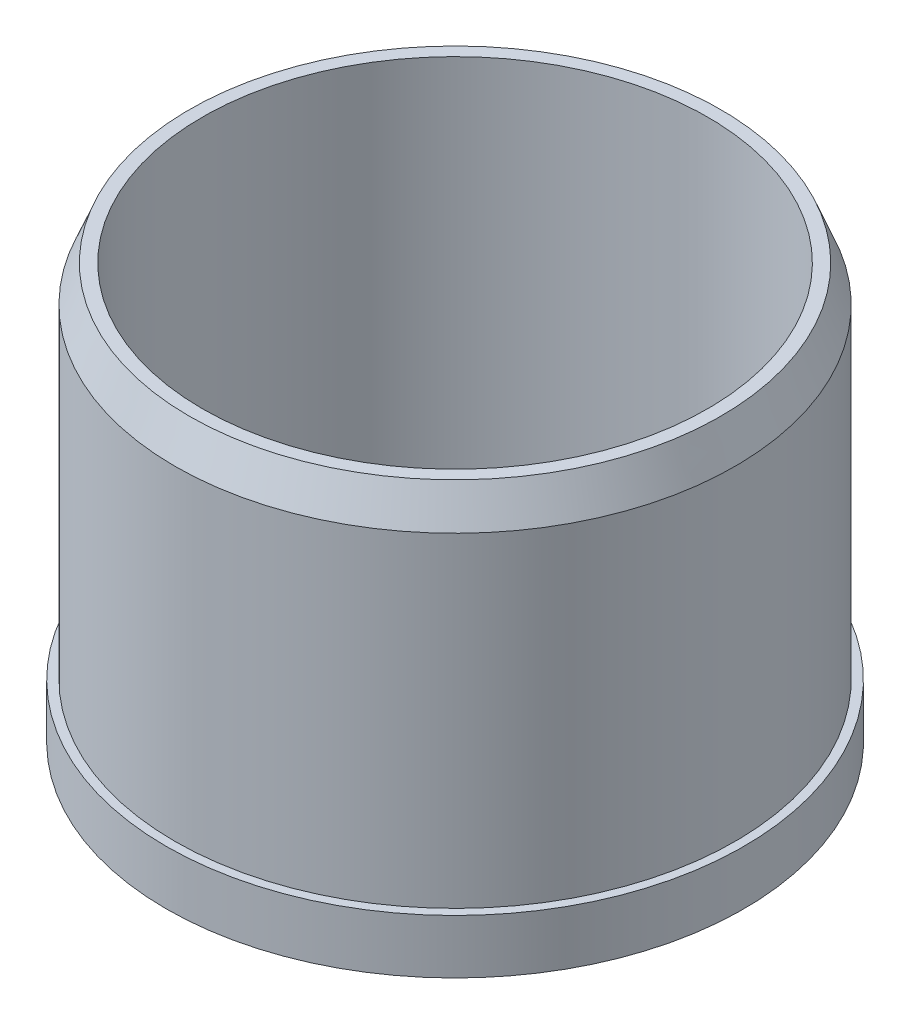
ISO-10303-21;
HEADER;
FILE_DESCRIPTION(('STEP AP214'),'2;1');
FILE_NAME('part.step','',(''),(''),'','','');
FILE_SCHEMA(('AUTOMOTIVE_DESIGN { 1 0 10303 214 1 1 1 1 }'));
ENDSEC;
DATA;
#1=APPLICATION_CONTEXT('core data for automotive mechanical design processes');
#2=APPLICATION_PROTOCOL_DEFINITION('international standard','automotive_design',2000,#1);
#3=PRODUCT_CONTEXT('',#1,'mechanical');
#4=PRODUCT('Part','Part','',(#3));
#5=PRODUCT_RELATED_PRODUCT_CATEGORY('part','',(#4));
#6=PRODUCT_DEFINITION_FORMATION('','',#4);
#7=PRODUCT_DEFINITION_CONTEXT('part definition',#1,'design');
#8=PRODUCT_DEFINITION('design','',#6,#7);
#9=PRODUCT_DEFINITION_SHAPE('','',#8);
#10=(LENGTH_UNIT() NAMED_UNIT(*) SI_UNIT(.MILLI.,.METRE.));
#11=(NAMED_UNIT(*) PLANE_ANGLE_UNIT() SI_UNIT($,.RADIAN.));
#12=(NAMED_UNIT(*) SI_UNIT($,.STERADIAN.) SOLID_ANGLE_UNIT());
#13=UNCERTAINTY_MEASURE_WITH_UNIT(LENGTH_MEASURE(1.E-05),#10,'distance_accuracy_value','');
#14=(GEOMETRIC_REPRESENTATION_CONTEXT(3) GLOBAL_UNCERTAINTY_ASSIGNED_CONTEXT((#13)) GLOBAL_UNIT_ASSIGNED_CONTEXT((#10,
#11,#12)) REPRESENTATION_CONTEXT('',''));
#15=CARTESIAN_POINT('',(0.,0.,0.));
#16=DIRECTION('',(0.,0.,1.));
#17=DIRECTION('',(1.,0.,0.));
#18=AXIS2_PLACEMENT_3D('',#15,#16,#17);
#19=CARTESIAN_POINT('',(0.,9.525,0.));
#20=DIRECTION('',(0.,1.,0.));
#21=DIRECTION('',(0.,0.,1.));
#22=AXIS2_PLACEMENT_3D('',#19,#20,#21);
#23=PLANE('',#22);
#24=CARTESIAN_POINT('',(0.,9.525,0.));
#25=DIRECTION('',(0.,1.,0.));
#26=DIRECTION('',(0.,0.,1.));
#27=AXIS2_PLACEMENT_3D('',#24,#25,#26);
#28=CIRCLE('',#27,12.7);
#29=CARTESIAN_POINT('',(0.,9.525,12.7));
#30=VERTEX_POINT('',#29);
#31=EDGE_CURVE('E88',#30,#30,#28,.T.);
#32=ORIENTED_EDGE('',*,*,#31,.F.);
#33=EDGE_LOOP('',(#32));
#34=FACE_BOUND('',#33,.T.);
#35=CARTESIAN_POINT('',(27.1764399531351,9.525,-8.83016061426567));
#36=DIRECTION('',(0.,1.,0.));
#37=DIRECTION('',(0.,0.,1.));
#38=AXIS2_PLACEMENT_3D('',#35,#36,#37);
#39=CIRCLE('',#38,12.7000000000007);
#40=CARTESIAN_POINT('',(27.1764399531351,9.525,3.86983938573504));
#41=VERTEX_POINT('',#40);
#42=EDGE_CURVE('E134',#41,#41,#39,.T.);
#43=ORIENTED_EDGE('',*,*,#42,.F.);
#44=EDGE_LOOP('',(#43));
#45=FACE_BOUND('',#44,.T.);
#46=CARTESIAN_POINT('',(16.7959635842603,9.525,23.1176606142632));
#47=DIRECTION('',(0.,1.,0.));
#48=DIRECTION('',(0.,0.,1.));
#49=AXIS2_PLACEMENT_3D('',#46,#47,#48);
#50=CIRCLE('',#49,12.7000000000027);
#51=CARTESIAN_POINT('',(16.7959635842603,9.525,35.8176606142658));
#52=VERTEX_POINT('',#51);
#53=EDGE_CURVE('E131',#52,#52,#50,.T.);
#54=ORIENTED_EDGE('',*,*,#53,.F.);
#55=EDGE_LOOP('',(#54));
#56=FACE_BOUND('',#55,.T.);
#57=CARTESIAN_POINT('',(-16.7959635842545,9.525,23.1176606142651));
#58=DIRECTION('',(0.,1.,0.));
#59=DIRECTION('',(0.,0.,1.));
#60=AXIS2_PLACEMENT_3D('',#57,#58,#59);
#61=CIRCLE('',#60,12.7000000000033);
#62=CARTESIAN_POINT('',(-16.7959635842545,9.525,35.8176606142684));
#63=VERTEX_POINT('',#62);
#64=EDGE_CURVE('E128',#63,#63,#61,.T.);
#65=ORIENTED_EDGE('',*,*,#64,.F.);
#66=EDGE_LOOP('',(#65));
#67=FACE_BOUND('',#66,.T.);
#68=CARTESIAN_POINT('',(-27.1764399531329,9.525,-8.83016061426258));
#69=DIRECTION('',(0.,1.,0.));
#70=DIRECTION('',(0.,0.,1.));
#71=AXIS2_PLACEMENT_3D('',#68,#69,#70);
#72=CIRCLE('',#71,12.7000000000018);
#73=CARTESIAN_POINT('',(-27.1764399531329,9.525,3.86983938573925));
#74=VERTEX_POINT('',#73);
#75=EDGE_CURVE('E124',#74,#74,#72,.T.);
#76=ORIENTED_EDGE('',*,*,#75,.F.);
#77=EDGE_LOOP('',(#76));
#78=FACE_BOUND('',#77,.T.);
#79=CARTESIAN_POINT('',(0.,9.525,-28.575));
#80=DIRECTION('',(0.,1.,0.));
#81=DIRECTION('',(0.,0.,1.));
#82=AXIS2_PLACEMENT_3D('',#79,#80,#81);
#83=CIRCLE('',#82,12.7);
#84=CARTESIAN_POINT('',(0.,9.525,-15.875));
#85=VERTEX_POINT('',#84);
#86=EDGE_CURVE('E121',#85,#85,#83,.T.);
#87=ORIENTED_EDGE('',*,*,#86,.F.);
#88=EDGE_LOOP('',(#87));
#89=FACE_BOUND('',#88,.T.);
#90=CARTESIAN_POINT('',(0.,9.525,0.));
#91=DIRECTION('',(0.,1.,0.));
#92=DIRECTION('',(0.,0.,1.));
#93=AXIS2_PLACEMENT_3D('',#90,#91,#92);
#94=CIRCLE('',#93,44.45);
#95=CARTESIAN_POINT('',(0.,9.525,44.45));
#96=VERTEX_POINT('',#95);
#97=EDGE_CURVE('E103',#96,#96,#94,.T.);
#98=ORIENTED_EDGE('',*,*,#97,.T.);
#99=EDGE_LOOP('',(#98));
#100=FACE_BOUND('',#99,.T.);
#101=ADVANCED_FACE('F42',(#34,#45,#56,#67,#78,#89,#100),#23,.T.);
#102=CARTESIAN_POINT('',(0.,9.525,0.));
#103=DIRECTION('',(0.,-1.,0.));
#104=DIRECTION('',(0.,0.,-1.));
#105=AXIS2_PLACEMENT_3D('',#102,#103,#104);
#106=CYLINDRICAL_SURFACE('',#105,7.1);
#107=CARTESIAN_POINT('',(0.,0.,0.));
#108=DIRECTION('',(0.,1.,0.));
#109=DIRECTION('',(0.,0.,1.));
#110=AXIS2_PLACEMENT_3D('',#107,#108,#109);
#111=CIRCLE('',#110,7.1);
#112=CARTESIAN_POINT('',(6.64529909033446,0.,-2.5));
#113=VERTEX_POINT('',#112);
#114=CARTESIAN_POINT('',(6.64529909033446,0.,2.5));
#115=VERTEX_POINT('',#114);
#116=EDGE_CURVE('E157',#113,#115,#111,.T.);
#117=ORIENTED_EDGE('',*,*,#116,.F.);
#118=DIRECTION('',(0.,-1.,0.));
#119=VECTOR('',#118,1.);
#120=CARTESIAN_POINT('',(6.64529909033446,9.525,-2.5));
#121=LINE('',#120,#119);
#122=CARTESIAN_POINT('',(6.64529909033446,25.4,-2.5));
#123=VERTEX_POINT('',#122);
#124=EDGE_CURVE('E120',#123,#113,#121,.T.);
#125=ORIENTED_EDGE('',*,*,#124,.F.);
#126=CARTESIAN_POINT('',(0.,25.4,0.));
#127=DIRECTION('',(0.,1.,0.));
#128=DIRECTION('',(0.,0.,1.));
#129=AXIS2_PLACEMENT_3D('',#126,#127,#128);
#130=CIRCLE('',#129,7.1);
#131=CARTESIAN_POINT('',(6.64529909033446,25.4,2.5));
#132=VERTEX_POINT('',#131);
#133=EDGE_CURVE('E87',#132,#123,#130,.F.);
#134=ORIENTED_EDGE('',*,*,#133,.F.);
#135=DIRECTION('',(0.,-1.,0.));
#136=VECTOR('',#135,1.);
#137=CARTESIAN_POINT('',(6.64529909033446,9.525,2.5));
#138=LINE('',#137,#136);
#139=EDGE_CURVE('E57',#132,#115,#138,.T.);
#140=ORIENTED_EDGE('',*,*,#139,.T.);
#141=EDGE_LOOP('',(#117,#125,#134,#140));
#142=FACE_BOUND('',#141,.T.);
#143=ADVANCED_FACE('F185',(#142),#106,.F.);
#144=CARTESIAN_POINT('',(0.,9.525,-2.5));
#145=DIRECTION('',(0.,0.,1.));
#146=DIRECTION('',(1.,0.,0.));
#147=AXIS2_PLACEMENT_3D('',#144,#145,#146);
#148=PLANE('',#147);
#149=DIRECTION('',(-1.,0.,0.));
#150=VECTOR('',#149,1.);
#151=CARTESIAN_POINT('',(0.,0.,-2.5));
#152=LINE('',#151,#150);
#153=CARTESIAN_POINT('',(9.6,0.,-2.5));
#154=VERTEX_POINT('',#153);
#155=EDGE_CURVE('E160',#154,#113,#152,.T.);
#156=ORIENTED_EDGE('',*,*,#155,.F.);
#157=DIRECTION('',(0.,-1.,0.));
#158=VECTOR('',#157,1.);
#159=CARTESIAN_POINT('',(9.6,9.525,-2.5));
#160=LINE('',#159,#158);
#161=CARTESIAN_POINT('',(9.6,25.4,-2.5));
#162=VERTEX_POINT('',#161);
#163=EDGE_CURVE('E98',#162,#154,#160,.T.);
#164=ORIENTED_EDGE('',*,*,#163,.F.);
#165=DIRECTION('',(1.,0.,0.));
#166=VECTOR('',#165,1.);
#167=CARTESIAN_POINT('',(0.,25.4,-2.5));
#168=LINE('',#167,#166);
#169=EDGE_CURVE('E102',#123,#162,#168,.T.);
#170=ORIENTED_EDGE('',*,*,#169,.F.);
#171=ORIENTED_EDGE('',*,*,#124,.T.);
#172=EDGE_LOOP('',(#156,#164,#170,#171));
#173=FACE_BOUND('',#172,.T.);
#174=ADVANCED_FACE('F192',(#173),#148,.T.);
#175=CARTESIAN_POINT('',(9.6,9.525,0.));
#176=DIRECTION('',(-1.,0.,0.));
#177=DIRECTION('',(0.,0.,1.));
#178=AXIS2_PLACEMENT_3D('',#175,#176,#177);
#179=PLANE('',#178);
#180=DIRECTION('',(0.,0.,-1.));
#181=VECTOR('',#180,1.);
#182=CARTESIAN_POINT('',(9.6,0.,0.));
#183=LINE('',#182,#181);
#184=CARTESIAN_POINT('',(9.6,0.,2.5));
#185=VERTEX_POINT('',#184);
#186=EDGE_CURVE('E97',#185,#154,#183,.T.);
#187=ORIENTED_EDGE('',*,*,#186,.F.);
#188=DIRECTION('',(0.,-1.,0.));
#189=VECTOR('',#188,1.);
#190=CARTESIAN_POINT('',(9.6,9.525,2.5));
#191=LINE('',#190,#189);
#192=CARTESIAN_POINT('',(9.6,25.4,2.5));
#193=VERTEX_POINT('',#192);
#194=EDGE_CURVE('E64',#193,#185,#191,.T.);
#195=ORIENTED_EDGE('',*,*,#194,.F.);
#196=DIRECTION('',(0.,0.,1.));
#197=VECTOR('',#196,1.);
#198=CARTESIAN_POINT('',(9.6,25.4,0.));
#199=LINE('',#198,#197);
#200=EDGE_CURVE('E94',#162,#193,#199,.T.);
#201=ORIENTED_EDGE('',*,*,#200,.F.);
#202=ORIENTED_EDGE('',*,*,#163,.T.);
#203=EDGE_LOOP('',(#187,#195,#201,#202));
#204=FACE_BOUND('',#203,.T.);
#205=ADVANCED_FACE('F93',(#204),#179,.T.);
#206=CARTESIAN_POINT('',(0.,9.525,0.));
#207=DIRECTION('',(0.,-1.,0.));
#208=DIRECTION('',(0.,0.,-1.));
#209=AXIS2_PLACEMENT_3D('',#206,#207,#208);
#210=CYLINDRICAL_SURFACE('',#209,50.8);
#211=CARTESIAN_POINT('',(0.,9.525,0.));
#212=DIRECTION('',(0.,1.,0.));
#213=DIRECTION('',(0.,0.,1.));
#214=AXIS2_PLACEMENT_3D('',#211,#212,#213);
#215=CIRCLE('',#214,50.8);
#216=CARTESIAN_POINT('',(0.,9.525,50.8));
#217=VERTEX_POINT('',#216);
#218=EDGE_CURVE('E137',#217,#217,#215,.T.);
#219=ORIENTED_EDGE('',*,*,#218,.F.);
#220=EDGE_LOOP('',(#219));
#221=FACE_BOUND('',#220,.T.);
#222=CARTESIAN_POINT('',(0.,0.,0.));
#223=DIRECTION('',(0.,1.,0.));
#224=DIRECTION('',(0.,0.,1.));
#225=AXIS2_PLACEMENT_3D('',#222,#223,#224);
#226=CIRCLE('',#225,50.8);
#227=CARTESIAN_POINT('',(0.,0.,50.8));
#228=VERTEX_POINT('',#227);
#229=EDGE_CURVE('E154',#228,#228,#226,.T.);
#230=ORIENTED_EDGE('',*,*,#229,.T.);
#231=EDGE_LOOP('',(#230));
#232=FACE_BOUND('',#231,.T.);
#233=ADVANCED_FACE('F213',(#221,#232),#210,.T.);
#234=CARTESIAN_POINT('',(27.1764399531351,9.525,-8.83016061426567));
#235=DIRECTION('',(0.,-1.,0.));
#236=DIRECTION('',(0.,0.,-1.));
#237=AXIS2_PLACEMENT_3D('',#234,#235,#236);
#238=CYLINDRICAL_SURFACE('',#237,12.7000000000007);
#239=ORIENTED_EDGE('',*,*,#42,.T.);
#240=EDGE_LOOP('',(#239));
#241=FACE_BOUND('',#240,.T.);
#242=CARTESIAN_POINT('',(27.1764399531351,0.,-8.83016061426567));
#243=DIRECTION('',(0.,1.,0.));
#244=DIRECTION('',(0.,0.,1.));
#245=AXIS2_PLACEMENT_3D('',#242,#243,#244);
#246=CIRCLE('',#245,12.7000000000007);
#247=CARTESIAN_POINT('',(27.1764399531351,0.,3.86983938573504));
#248=VERTEX_POINT('',#247);
#249=EDGE_CURVE('E151',#248,#248,#246,.T.);
#250=ORIENTED_EDGE('',*,*,#249,.F.);
#251=EDGE_LOOP('',(#250));
#252=FACE_BOUND('',#251,.T.);
#253=ADVANCED_FACE('F216',(#241,#252),#238,.F.);
#254=CARTESIAN_POINT('',(16.7959635842603,9.525,23.1176606142632));
#255=DIRECTION('',(0.,-1.,0.));
#256=DIRECTION('',(0.,0.,-1.));
#257=AXIS2_PLACEMENT_3D('',#254,#255,#256);
#258=CYLINDRICAL_SURFACE('',#257,12.7000000000027);
#259=ORIENTED_EDGE('',*,*,#53,.T.);
#260=EDGE_LOOP('',(#259));
#261=FACE_BOUND('',#260,.T.);
#262=CARTESIAN_POINT('',(16.7959635842603,0.,23.1176606142632));
#263=DIRECTION('',(0.,1.,0.));
#264=DIRECTION('',(0.,0.,1.));
#265=AXIS2_PLACEMENT_3D('',#262,#263,#264);
#266=CIRCLE('',#265,12.7000000000027);
#267=CARTESIAN_POINT('',(16.7959635842603,0.,35.8176606142658));
#268=VERTEX_POINT('',#267);
#269=EDGE_CURVE('E148',#268,#268,#266,.T.);
#270=ORIENTED_EDGE('',*,*,#269,.F.);
#271=EDGE_LOOP('',(#270));
#272=FACE_BOUND('',#271,.T.);
#273=ADVANCED_FACE('F232',(#261,#272),#258,.F.);
#274=CARTESIAN_POINT('',(-16.7959635842545,9.525,23.1176606142651));
#275=DIRECTION('',(0.,-1.,0.));
#276=DIRECTION('',(0.,0.,-1.));
#277=AXIS2_PLACEMENT_3D('',#274,#275,#276);
#278=CYLINDRICAL_SURFACE('',#277,12.7000000000033);
#279=ORIENTED_EDGE('',*,*,#64,.T.);
#280=EDGE_LOOP('',(#279));
#281=FACE_BOUND('',#280,.T.);
#282=CARTESIAN_POINT('',(-16.7959635842545,0.,23.1176606142651));
#283=DIRECTION('',(0.,1.,0.));
#284=DIRECTION('',(0.,0.,1.));
#285=AXIS2_PLACEMENT_3D('',#282,#283,#284);
#286=CIRCLE('',#285,12.7000000000033);
#287=CARTESIAN_POINT('',(-16.7959635842545,0.,35.8176606142684));
#288=VERTEX_POINT('',#287);
#289=EDGE_CURVE('E145',#288,#288,#286,.T.);
#290=ORIENTED_EDGE('',*,*,#289,.F.);
#291=EDGE_LOOP('',(#290));
#292=FACE_BOUND('',#291,.T.);
#293=ADVANCED_FACE('F236',(#281,#292),#278,.F.);
#294=CARTESIAN_POINT('',(-27.1764399531329,9.525,-8.83016061426258));
#295=DIRECTION('',(0.,-1.,0.));
#296=DIRECTION('',(0.,0.,-1.));
#297=AXIS2_PLACEMENT_3D('',#294,#295,#296);
#298=CYLINDRICAL_SURFACE('',#297,12.7000000000018);
#299=ORIENTED_EDGE('',*,*,#75,.T.);
#300=EDGE_LOOP('',(#299));
#301=FACE_BOUND('',#300,.T.);
#302=CARTESIAN_POINT('',(-27.1764399531329,0.,-8.83016061426258));
#303=DIRECTION('',(0.,1.,0.));
#304=DIRECTION('',(0.,0.,1.));
#305=AXIS2_PLACEMENT_3D('',#302,#303,#304);
#306=CIRCLE('',#305,12.7000000000018);
#307=CARTESIAN_POINT('',(-27.1764399531329,0.,3.86983938573925));
#308=VERTEX_POINT('',#307);
#309=EDGE_CURVE('E142',#308,#308,#306,.T.);
#310=ORIENTED_EDGE('',*,*,#309,.F.);
#311=EDGE_LOOP('',(#310));
#312=FACE_BOUND('',#311,.T.);
#313=ADVANCED_FACE('F240',(#301,#312),#298,.F.);
#314=CARTESIAN_POINT('',(0.,9.525,-28.575));
#315=DIRECTION('',(0.,-1.,0.));
#316=DIRECTION('',(0.,0.,-1.));
#317=AXIS2_PLACEMENT_3D('',#314,#315,#316);
#318=CYLINDRICAL_SURFACE('',#317,12.7);
#319=ORIENTED_EDGE('',*,*,#86,.T.);
#320=EDGE_LOOP('',(#319));
#321=FACE_BOUND('',#320,.T.);
#322=CARTESIAN_POINT('',(0.,0.,-28.575));
#323=DIRECTION('',(0.,1.,0.));
#324=DIRECTION('',(0.,0.,1.));
#325=AXIS2_PLACEMENT_3D('',#322,#323,#324);
#326=CIRCLE('',#325,12.7);
#327=CARTESIAN_POINT('',(0.,0.,-15.875));
#328=VERTEX_POINT('',#327);
#329=EDGE_CURVE('E114',#328,#328,#326,.T.);
#330=ORIENTED_EDGE('',*,*,#329,.F.);
#331=EDGE_LOOP('',(#330));
#332=FACE_BOUND('',#331,.T.);
#333=ADVANCED_FACE('F207',(#321,#332),#318,.F.);
#334=CARTESIAN_POINT('',(0.,9.525,2.5));
#335=DIRECTION('',(0.,0.,1.));
#336=DIRECTION('',(1.,0.,0.));
#337=AXIS2_PLACEMENT_3D('',#334,#335,#336);
#338=PLANE('',#337);
#339=DIRECTION('',(-1.,0.,0.));
#340=VECTOR('',#339,1.);
#341=CARTESIAN_POINT('',(0.,0.,2.5));
#342=LINE('',#341,#340);
#343=EDGE_CURVE('E125',#185,#115,#342,.T.);
#344=ORIENTED_EDGE('',*,*,#343,.T.);
#345=ORIENTED_EDGE('',*,*,#139,.F.);
#346=DIRECTION('',(-1.,0.,0.));
#347=VECTOR('',#346,1.);
#348=CARTESIAN_POINT('',(0.,25.4,2.5));
#349=LINE('',#348,#347);
#350=EDGE_CURVE('E82',#193,#132,#349,.T.);
#351=ORIENTED_EDGE('',*,*,#350,.F.);
#352=ORIENTED_EDGE('',*,*,#194,.T.);
#353=EDGE_LOOP('',(#344,#345,#351,#352));
#354=FACE_BOUND('',#353,.T.);
#355=ADVANCED_FACE('F83',(#354),#338,.F.);
#356=CARTESIAN_POINT('',(0.,9.525,0.));
#357=DIRECTION('',(0.,1.,0.));
#358=DIRECTION('',(0.,0.,1.));
#359=AXIS2_PLACEMENT_3D('',#356,#357,#358);
#360=CIRCLE('',#359,49.276);
#361=CARTESIAN_POINT('',(0.,9.525,49.276));
#362=VERTEX_POINT('',#361);
#363=EDGE_CURVE('E116',#362,#362,#360,.T.);
#364=ORIENTED_EDGE('',*,*,#363,.F.);
#365=EDGE_LOOP('',(#364));
#366=FACE_BOUND('',#365,.T.);
#367=ORIENTED_EDGE('',*,*,#218,.T.);
#368=EDGE_LOOP('',(#367));
#369=FACE_BOUND('',#368,.T.);
#370=ADVANCED_FACE('F188',(#366,#369),#23,.T.);
#371=CARTESIAN_POINT('',(0.,0.,0.));
#372=DIRECTION('',(0.,1.,0.));
#373=DIRECTION('',(0.,0.,1.));
#374=AXIS2_PLACEMENT_3D('',#371,#372,#373);
#375=PLANE('',#374);
#376=ORIENTED_EDGE('',*,*,#329,.T.);
#377=EDGE_LOOP('',(#376));
#378=FACE_BOUND('',#377,.T.);
#379=ORIENTED_EDGE('',*,*,#309,.T.);
#380=EDGE_LOOP('',(#379));
#381=FACE_BOUND('',#380,.T.);
#382=ORIENTED_EDGE('',*,*,#289,.T.);
#383=EDGE_LOOP('',(#382));
#384=FACE_BOUND('',#383,.T.);
#385=ORIENTED_EDGE('',*,*,#269,.T.);
#386=EDGE_LOOP('',(#385));
#387=FACE_BOUND('',#386,.T.);
#388=ORIENTED_EDGE('',*,*,#249,.T.);
#389=EDGE_LOOP('',(#388));
#390=FACE_BOUND('',#389,.T.);
#391=ORIENTED_EDGE('',*,*,#229,.F.);
#392=EDGE_LOOP('',(#391));
#393=FACE_BOUND('',#392,.T.);
#394=ORIENTED_EDGE('',*,*,#116,.T.);
#395=ORIENTED_EDGE('',*,*,#343,.F.);
#396=ORIENTED_EDGE('',*,*,#186,.T.);
#397=ORIENTED_EDGE('',*,*,#155,.T.);
#398=EDGE_LOOP('',(#394,#395,#396,#397));
#399=FACE_BOUND('',#398,.T.);
#400=ADVANCED_FACE('F199',(#378,#381,#384,#387,#390,#393,#399),#375,.F.);
#401=CARTESIAN_POINT('',(0.,73.025,0.));
#402=DIRECTION('',(0.,1.,0.));
#403=DIRECTION('',(0.,0.,1.));
#404=AXIS2_PLACEMENT_3D('',#401,#402,#403);
#405=PLANE('',#404);
#406=CARTESIAN_POINT('',(0.,73.025,0.));
#407=DIRECTION('',(0.,1.,0.));
#408=DIRECTION('',(0.,0.,1.));
#409=AXIS2_PLACEMENT_3D('',#406,#407,#408);
#410=CIRCLE('',#409,46.736);
#411=CARTESIAN_POINT('',(0.,73.025,46.736));
#412=VERTEX_POINT('',#411);
#413=EDGE_CURVE('E119',#412,#412,#410,.T.);
#414=ORIENTED_EDGE('',*,*,#413,.T.);
#415=EDGE_LOOP('',(#414));
#416=FACE_BOUND('',#415,.T.);
#417=CARTESIAN_POINT('',(0.,73.025,0.));
#418=DIRECTION('',(0.,1.,0.));
#419=DIRECTION('',(0.,0.,1.));
#420=AXIS2_PLACEMENT_3D('',#417,#418,#419);
#421=CIRCLE('',#420,44.45);
#422=CARTESIAN_POINT('',(0.,73.025,44.45));
#423=VERTEX_POINT('',#422);
#424=EDGE_CURVE('E106',#423,#423,#421,.T.);
#425=ORIENTED_EDGE('',*,*,#424,.F.);
#426=EDGE_LOOP('',(#425));
#427=FACE_BOUND('',#426,.T.);
#428=ADVANCED_FACE('F205',(#416,#427),#405,.T.);
#429=CARTESIAN_POINT('',(0.,73.025,0.));
#430=DIRECTION('',(0.,-1.,0.));
#431=DIRECTION('',(0.,0.,-1.));
#432=AXIS2_PLACEMENT_3D('',#429,#430,#431);
#433=CYLINDRICAL_SURFACE('',#432,49.276);
#434=CARTESIAN_POINT('',(0.,66.675,0.));
#435=DIRECTION('',(0.,1.,0.));
#436=DIRECTION('',(0.,0.,1.));
#437=AXIS2_PLACEMENT_3D('',#434,#435,#436);
#438=CIRCLE('',#437,49.276);
#439=CARTESIAN_POINT('',(0.,66.675,49.276));
#440=VERTEX_POINT('',#439);
#441=EDGE_CURVE('E170',#440,#440,#438,.F.);
#442=ORIENTED_EDGE('',*,*,#441,.T.);
#443=EDGE_LOOP('',(#442));
#444=FACE_BOUND('',#443,.T.);
#445=ORIENTED_EDGE('',*,*,#363,.T.);
#446=EDGE_LOOP('',(#445));
#447=FACE_BOUND('',#446,.T.);
#448=ADVANCED_FACE('F268',(#444,#447),#433,.T.);
#449=CARTESIAN_POINT('',(0.,73.025,0.));
#450=DIRECTION('',(0.,-1.,0.));
#451=DIRECTION('',(0.,0.,-1.));
#452=AXIS2_PLACEMENT_3D('',#449,#450,#451);
#453=CYLINDRICAL_SURFACE('',#452,44.45);
#454=ORIENTED_EDGE('',*,*,#424,.T.);
#455=EDGE_LOOP('',(#454));
#456=FACE_BOUND('',#455,.T.);
#457=ORIENTED_EDGE('',*,*,#97,.F.);
#458=EDGE_LOOP('',(#457));
#459=FACE_BOUND('',#458,.T.);
#460=ADVANCED_FACE('F259',(#456,#459),#453,.F.);
#461=CARTESIAN_POINT('',(0.,25.4,0.));
#462=DIRECTION('',(0.,-1.,0.));
#463=DIRECTION('',(0.,0.,-1.));
#464=AXIS2_PLACEMENT_3D('',#461,#462,#463);
#465=CYLINDRICAL_SURFACE('',#464,12.7);
#466=CARTESIAN_POINT('',(0.,29.21,0.));
#467=DIRECTION('',(0.,1.,0.));
#468=DIRECTION('',(0.,0.,1.));
#469=AXIS2_PLACEMENT_3D('',#466,#467,#468);
#470=CIRCLE('',#469,12.7);
#471=CARTESIAN_POINT('',(0.,29.21,12.7));
#472=VERTEX_POINT('',#471);
#473=EDGE_CURVE('E11',#472,#472,#470,.F.);
#474=ORIENTED_EDGE('',*,*,#473,.T.);
#475=EDGE_LOOP('',(#474));
#476=FACE_BOUND('',#475,.T.);
#477=ORIENTED_EDGE('',*,*,#31,.T.);
#478=EDGE_LOOP('',(#477));
#479=FACE_BOUND('',#478,.T.);
#480=ADVANCED_FACE('F252',(#476,#479),#465,.T.);
#481=CARTESIAN_POINT('',(0.,73.025,0.));
#482=DIRECTION('',(0.,-1.,0.));
#483=DIRECTION('',(0.,0.,-1.));
#484=AXIS2_PLACEMENT_3D('',#481,#482,#483);
#485=CONICAL_SURFACE('',#484,46.736,0.380506377112363);
#486=ORIENTED_EDGE('',*,*,#441,.F.);
#487=EDGE_LOOP('',(#486));
#488=FACE_BOUND('',#487,.T.);
#489=ORIENTED_EDGE('',*,*,#413,.F.);
#490=EDGE_LOOP('',(#489));
#491=FACE_BOUND('',#490,.T.);
#492=ADVANCED_FACE('F248',(#488,#491),#485,.T.);
#493=CARTESIAN_POINT('',(0.,25.4,0.));
#494=DIRECTION('',(0.,1.,0.));
#495=DIRECTION('',(0.,0.,1.));
#496=AXIS2_PLACEMENT_3D('',#493,#494,#495);
#497=PLANE('',#496);
#498=ORIENTED_EDGE('',*,*,#200,.T.);
#499=ORIENTED_EDGE('',*,*,#350,.T.);
#500=ORIENTED_EDGE('',*,*,#133,.T.);
#501=ORIENTED_EDGE('',*,*,#169,.T.);
#502=EDGE_LOOP('',(#498,#499,#500,#501));
#503=FACE_BOUND('',#502,.T.);
#504=ADVANCED_FACE('F100',(#503),#497,.F.);
#505=CARTESIAN_POINT('',(0.,31.75,0.));
#506=DIRECTION('',(0.,1.,0.));
#507=DIRECTION('',(0.,0.,1.));
#508=AXIS2_PLACEMENT_3D('',#505,#506,#507);
#509=PLANE('',#508);
#510=CARTESIAN_POINT('',(0.,31.75,0.));
#511=DIRECTION('',(0.,1.,0.));
#512=DIRECTION('',(0.,0.,1.));
#513=AXIS2_PLACEMENT_3D('',#510,#511,#512);
#514=CIRCLE('',#513,10.16);
#515=CARTESIAN_POINT('',(0.,31.75,10.16));
#516=VERTEX_POINT('',#515);
#517=EDGE_CURVE('E50',#516,#516,#514,.T.);
#518=ORIENTED_EDGE('',*,*,#517,.T.);
#519=EDGE_LOOP('',(#518));
#520=FACE_BOUND('',#519,.T.);
#521=ADVANCED_FACE('F175',(#520),#509,.T.);
#522=CARTESIAN_POINT('',(0.,29.21,0.));
#523=DIRECTION('',(0.,1.,0.));
#524=DIRECTION('',(0.,0.,1.));
#525=AXIS2_PLACEMENT_3D('',#522,#523,#524);
#526=TOROIDAL_SURFACE('',#525,10.16,2.54);
#527=ORIENTED_EDGE('',*,*,#473,.F.);
#528=EDGE_LOOP('',(#527));
#529=FACE_BOUND('',#528,.T.);
#530=ORIENTED_EDGE('',*,*,#517,.F.);
#531=EDGE_LOOP('',(#530));
#532=FACE_BOUND('',#531,.T.);
#533=ADVANCED_FACE('F44',(#529,#532),#526,.T.);
#534=CLOSED_SHELL('',(#101,#143,#174,#205,#233,#253,#273,#293,#313,#333,#355,#370,#400,#428,
#448,#460,#480,#492,#504,#521,#533));
#535=MANIFOLD_SOLID_BREP('B2',#534);
#536=ADVANCED_BREP_SHAPE_REPRESENTATION('',(#18,#535),#14);
#537=SHAPE_DEFINITION_REPRESENTATION(#9,#536);
ENDSEC;
END-ISO-10303-21;
